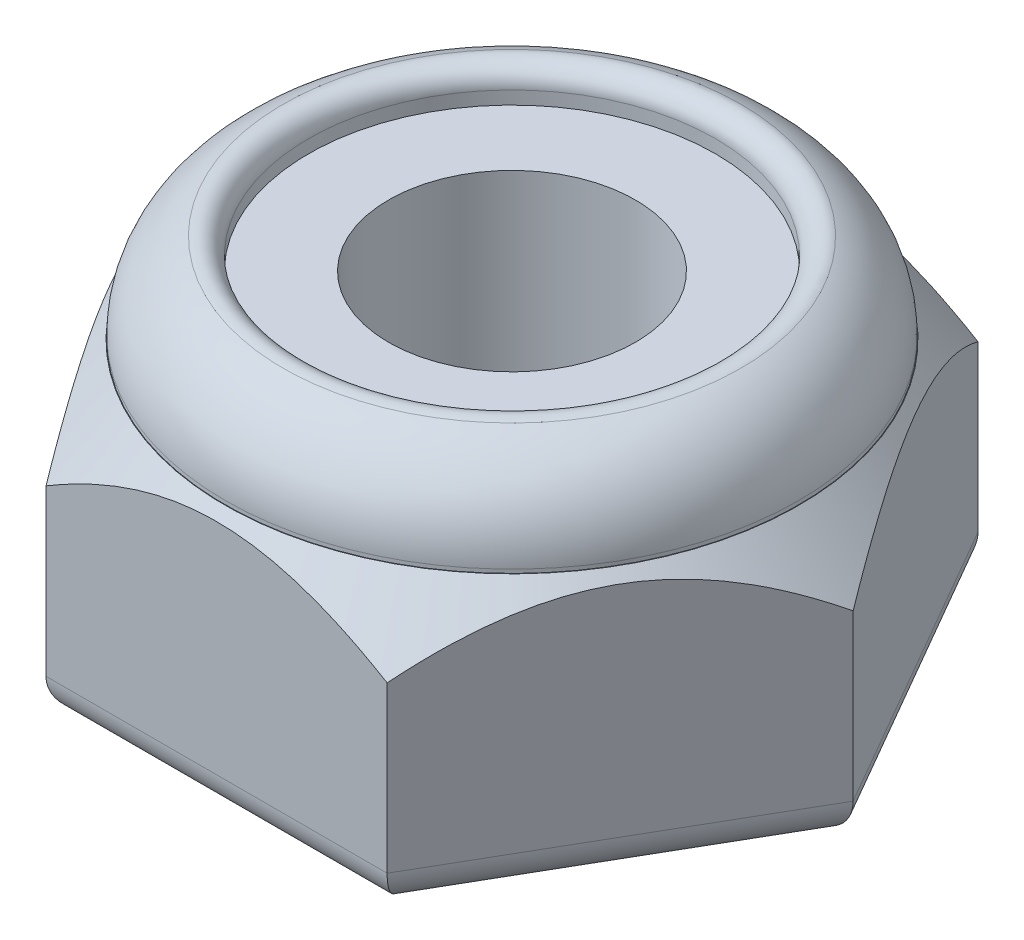
ISO-10303-21;
HEADER;
FILE_DESCRIPTION(('STEP AP214'),'2;1');
FILE_NAME('part.step','',(''),(''),'','','');
FILE_SCHEMA(('AUTOMOTIVE_DESIGN { 1 0 10303 214 1 1 1 1 }'));
ENDSEC;
DATA;
#1=APPLICATION_CONTEXT('core data for automotive mechanical design processes');
#2=APPLICATION_PROTOCOL_DEFINITION('international standard','automotive_design',2000,#1);
#3=PRODUCT_CONTEXT('',#1,'mechanical');
#4=PRODUCT('Part','Part','',(#3));
#5=PRODUCT_RELATED_PRODUCT_CATEGORY('part','',(#4));
#6=PRODUCT_DEFINITION_FORMATION('','',#4);
#7=PRODUCT_DEFINITION_CONTEXT('part definition',#1,'design');
#8=PRODUCT_DEFINITION('design','',#6,#7);
#9=PRODUCT_DEFINITION_SHAPE('','',#8);
#10=(LENGTH_UNIT() NAMED_UNIT(*) SI_UNIT(.MILLI.,.METRE.));
#11=(NAMED_UNIT(*) PLANE_ANGLE_UNIT() SI_UNIT($,.RADIAN.));
#12=(NAMED_UNIT(*) SI_UNIT($,.STERADIAN.) SOLID_ANGLE_UNIT());
#13=UNCERTAINTY_MEASURE_WITH_UNIT(LENGTH_MEASURE(1.E-05),#10,'distance_accuracy_value','');
#14=(GEOMETRIC_REPRESENTATION_CONTEXT(3) GLOBAL_UNCERTAINTY_ASSIGNED_CONTEXT((#13)) GLOBAL_UNIT_ASSIGNED_CONTEXT((#10,
#11,#12)) REPRESENTATION_CONTEXT('',''));
#15=CARTESIAN_POINT('',(0.,0.,0.));
#16=DIRECTION('',(0.,0.,1.));
#17=DIRECTION('',(1.,0.,0.));
#18=AXIS2_PLACEMENT_3D('',#15,#16,#17);
#19=CARTESIAN_POINT('',(0.,4.9784,0.));
#20=DIRECTION('',(0.,-1.,0.));
#21=DIRECTION('',(0.,0.,-1.));
#22=AXIS2_PLACEMENT_3D('',#19,#20,#21);
#23=CYLINDRICAL_SURFACE('',#22,3.937);
#24=CARTESIAN_POINT('',(0.,3.7084,0.));
#25=DIRECTION('',(0.,1.,0.));
#26=DIRECTION('',(0.,0.,1.));
#27=AXIS2_PLACEMENT_3D('',#24,#25,#26);
#28=CIRCLE('',#27,3.937);
#29=CARTESIAN_POINT('',(0.,3.7084,3.937));
#30=VERTEX_POINT('',#29);
#31=EDGE_CURVE('E244',#30,#30,#28,.T.);
#32=ORIENTED_EDGE('',*,*,#31,.F.);
#33=EDGE_LOOP('',(#32));
#34=FACE_BOUND('',#33,.T.);
#35=CARTESIAN_POINT('',(0.,3.6576,0.));
#36=DIRECTION('',(0.,-1.,0.));
#37=DIRECTION('',(0.,0.,-1.));
#38=AXIS2_PLACEMENT_3D('',#35,#36,#37);
#39=CIRCLE('',#38,3.937);
#40=CARTESIAN_POINT('',(0.,3.6576,-3.937));
#41=VERTEX_POINT('',#40);
#42=EDGE_CURVE('E19',#41,#41,#39,.F.);
#43=ORIENTED_EDGE('',*,*,#42,.T.);
#44=EDGE_LOOP('',(#43));
#45=FACE_BOUND('',#44,.T.);
#46=ADVANCED_FACE('F16',(#34,#45),#23,.T.);
#47=CARTESIAN_POINT('',(0.,3.7084,0.));
#48=DIRECTION('',(0.,1.,0.));
#49=DIRECTION('',(0.,0.,1.));
#50=AXIS2_PLACEMENT_3D('',#47,#48,#49);
#51=TOROIDAL_SURFACE('',#50,2.667,1.27);
#52=ORIENTED_EDGE('',*,*,#31,.T.);
#53=EDGE_LOOP('',(#52));
#54=FACE_BOUND('',#53,.T.);
#55=CARTESIAN_POINT('',(0.,4.88572150982644,0.));
#56=DIRECTION('',(0.,-1.,0.));
#57=DIRECTION('',(0.,0.,-1.));
#58=AXIS2_PLACEMENT_3D('',#55,#56,#57);
#59=CIRCLE('',#58,3.14325);
#60=CARTESIAN_POINT('',(0.,4.88572150982644,-3.14325));
#61=VERTEX_POINT('',#60);
#62=EDGE_CURVE('E238',#61,#61,#59,.F.);
#63=ORIENTED_EDGE('',*,*,#62,.F.);
#64=EDGE_LOOP('',(#63));
#65=FACE_BOUND('',#64,.T.);
#66=ADVANCED_FACE('F134',(#54,#65),#51,.T.);
#67=CARTESIAN_POINT('',(2.34315,3.6576,4.05845484975502));
#68=DIRECTION('',(0.,-1.,0.));
#69=DIRECTION('',(0.,0.,-1.));
#70=AXIS2_PLACEMENT_3D('',#67,#68,#69);
#71=PLANE('',#70);
#72=ORIENTED_EDGE('',*,*,#42,.F.);
#73=EDGE_LOOP('',(#72));
#74=FACE_BOUND('',#73,.T.);
#75=CARTESIAN_POINT('',(0.,3.65760000011051,0.));
#76=DIRECTION('',(0.,-1.,0.));
#77=DIRECTION('',(0.,0.,-1.));
#78=AXIS2_PLACEMENT_3D('',#75,#76,#77);
#79=CIRCLE('',#78,3.94407100938664);
#80=CARTESIAN_POINT('',(0.,3.65760000011051,-3.94407100938664));
#81=VERTEX_POINT('',#80);
#82=EDGE_CURVE('E119',#81,#81,#79,.T.);
#83=ORIENTED_EDGE('',*,*,#82,.F.);
#84=EDGE_LOOP('',(#83));
#85=FACE_BOUND('',#84,.T.);
#86=ADVANCED_FACE('F129',(#74,#85),#71,.F.);
#87=CARTESIAN_POINT('',(0.,4.65025720786115,0.));
#88=DIRECTION('',(0.,-1.,0.));
#89=DIRECTION('',(0.,0.,-1.));
#90=AXIS2_PLACEMENT_3D('',#87,#88,#89);
#91=TOROIDAL_SURFACE('',#90,3.048,0.254);
#92=CARTESIAN_POINT('',(0.,4.65025720786115,0.));
#93=DIRECTION('',(0.,1.,0.));
#94=DIRECTION('',(0.,0.,1.));
#95=AXIS2_PLACEMENT_3D('',#92,#93,#94);
#96=CIRCLE('',#95,2.794);
#97=CARTESIAN_POINT('',(0.,4.65025720786115,2.794));
#98=VERTEX_POINT('',#97);
#99=EDGE_CURVE('E104',#98,#98,#96,.F.);
#100=ORIENTED_EDGE('',*,*,#99,.T.);
#101=EDGE_LOOP('',(#100));
#102=FACE_BOUND('',#101,.T.);
#103=ORIENTED_EDGE('',*,*,#62,.T.);
#104=EDGE_LOOP('',(#103));
#105=FACE_BOUND('',#104,.T.);
#106=ADVANCED_FACE('F125',(#102,#105),#91,.T.);
#107=CARTESIAN_POINT('',(0.,2.76773860969115,0.));
#108=DIRECTION('',(0.,-1.,0.));
#109=DIRECTION('',(0.,0.,-1.));
#110=AXIS2_PLACEMENT_3D('',#107,#108,#109);
#111=CONICAL_SURFACE('',#110,4.69075337389313,0.698131700802158);
#112=CARTESIAN_POINT('',(-4.68630000001476,2.77304593398821,-5.33338044389321E-11));
#113=CARTESIAN_POINT('',(-4.65177717141793,2.81418235889091,0.0597952931149053));
#114=CARTESIAN_POINT('',(-4.61695780288956,2.85432113110728,0.120104208500933));
#115=CARTESIAN_POINT('',(-4.54666264441453,2.93230661020916,0.241858994511412));
#116=CARTESIAN_POINT('',(-4.51118655194523,2.97015222462005,0.303305389120424));
#117=CARTESIAN_POINT('',(-4.40329561885259,3.08018701500149,0.490177966909937));
#118=CARTESIAN_POINT('',(-4.32983334004397,3.14837015576205,0.617418366247689));
#119=CARTESIAN_POINT('',(-4.1797796499728,3.27092778609509,0.877318981315214));
#120=CARTESIAN_POINT('',(-4.10317943932402,3.32525984886677,1.00999443802899));
#121=CARTESIAN_POINT('',(-3.94747591651277,3.41577217646148,1.27968085045525));
#122=CARTESIAN_POINT('',(-3.86837998243724,3.45200143013375,1.4166790269463));
#123=CARTESIAN_POINT('',(-3.73746585196202,3.49372811243502,1.64342895235813));
#124=CARTESIAN_POINT('',(-3.68614686019516,3.50560413715319,1.73231605349153));
#125=CARTESIAN_POINT('',(-3.58316406708587,3.52008140702852,1.91068748346216));
#126=CARTESIAN_POINT('',(-3.53150020834088,3.5226810675312,2.00017191172355));
#127=CARTESIAN_POINT('',(-3.42855034551142,3.51847006524789,2.17848630477643));
#128=CARTESIAN_POINT('',(-3.3772638088531,3.51171021118306,2.26731719201287));
#129=CARTESIAN_POINT('',(-3.27519197708947,3.48921023555424,2.4441107906491));
#130=CARTESIAN_POINT('',(-3.22440670715057,3.4734696654174,2.53207345845939));
#131=CARTESIAN_POINT('',(-3.10963060134479,3.42817062222156,2.73087150520989));
#132=CARTESIAN_POINT('',(-3.04589899577138,3.39598542076133,2.84125788411099));
#133=CARTESIAN_POINT('',(-2.92018166739655,3.32004827846255,3.05900668424801));
#134=CARTESIAN_POINT('',(-2.85819691962206,3.27629001415058,3.16636741668776));
#135=CARTESIAN_POINT('',(-2.735889068299,3.17910361386979,3.37821082934389));
#136=CARTESIAN_POINT('',(-2.67557364738244,3.12563730731956,3.48268020285126));
#137=CARTESIAN_POINT('',(-2.55683004320588,3.01104764609313,3.68835015835892));
#138=CARTESIAN_POINT('',(-2.49840123089761,2.94992687749399,3.78955182990274));
#139=CARTESIAN_POINT('',(-2.42439626092569,2.86741854625153,3.91773219790672));
#140=CARTESIAN_POINT('',(-2.40802320106583,2.84883596648691,3.94609116945937));
#141=CARTESIAN_POINT('',(-2.3754621576302,2.81125673907332,4.00248855103733));
#142=CARTESIAN_POINT('',(-2.35927376441604,2.79226151161516,4.03052767057717));
#143=CARTESIAN_POINT('',(-2.3431499999717,2.77304593399368,4.05845484980404));
#144=B_SPLINE_CURVE_WITH_KNOTS('',3,(#112,#113,#114,#115,#116,#117,#118,#119,#120,#121,#122,
#123,#124,#125,#126,#127,#128,#129,#130,#131,#132,#133,#134,#135,#136,#137,#138,#139,#140,#141,
#142,#143),.UNSPECIFIED.,.F.,.F.,(4,2,2,2,2,2,2,2,2,2,2,2,2,2,2,4),(0.,0.241096809088565,
0.48230758945251,0.967637153847366,1.45443592242802,1.93991010956963,2.24950193433618,
2.55914664324831,2.86711700071403,3.17510274216898,3.56882084711336,3.96275452403261,
4.35827201930639,4.75365624679115,4.86660838982692,4.97921936905084),.UNSPECIFIED.);
#145=CARTESIAN_POINT('',(-4.68630000002839,2.77304593399358,0.));
#146=VERTEX_POINT('',#145);
#147=CARTESIAN_POINT('',(-2.34315000001419,2.77304593399358,4.05845484977959));
#148=VERTEX_POINT('',#147);
#149=EDGE_CURVE('E91',#146,#148,#144,.T.);
#150=ORIENTED_EDGE('',*,*,#149,.T.);
#151=CARTESIAN_POINT('',(-2.34315000005357,2.77304593398822,4.05845484974113));
#152=CARTESIAN_POINT('',(-2.27415972170409,2.81414935271336,4.05845484974989));
#153=CARTESIAN_POINT('',(-2.20457738522044,2.85425669884705,4.05845484975361));
#154=CARTESIAN_POINT('',(-2.06410193528095,2.93218331968194,4.05845484975642));
#155=CARTESIAN_POINT('',(-1.99320821641151,2.9700015013142,4.05845484975551));
#156=CARTESIAN_POINT('',(-1.77754688772429,3.07999086386455,4.05845484975401));
#157=CARTESIAN_POINT('',(-1.63068545869954,3.1481589403704,4.05845484975469));
#158=CARTESIAN_POINT('',(-1.33052752457963,3.27077676919262,4.05845484975534));
#159=CARTESIAN_POINT('',(-1.17720631609342,3.32516696804196,4.0584548497553));
#160=CARTESIAN_POINT('',(-0.86561350380778,3.41574608766059,4.05845484975473));
#161=CARTESIAN_POINT('',(-0.707359229311903,3.45199244874899,4.0584548497542));
#162=CARTESIAN_POINT('',(-0.456822143345071,3.49192146546895,4.05845484975548));
#163=CARTESIAN_POINT('',(-0.365672921156202,3.50290887295604,4.05845484975637));
#164=CARTESIAN_POINT('',(-0.183016322004482,3.51758027913678,4.05845484975366));
#165=CARTESIAN_POINT('',(-0.0915105175250816,3.52128341037061,4.05845484975007));
#166=CARTESIAN_POINT('',(0.104649468641441,3.52128177491765,4.0584548497495));
#167=CARTESIAN_POINT('',(0.209305100872023,3.51643705333648,4.05845484975354));
#168=CARTESIAN_POINT('',(0.41778718190987,3.49730239560235,4.05845484975649));
#169=CARTESIAN_POINT('',(0.521613181352877,3.48300765111694,4.05845484975541));
#170=CARTESIAN_POINT('',(0.728332544913561,3.44553375886282,4.05845484975462));
#171=CARTESIAN_POINT('',(0.831215331558566,3.42229697724238,4.05845484975491));
#172=CARTESIAN_POINT('',(1.03487580391125,3.36791830054733,4.05845484975512));
#173=CARTESIAN_POINT('',(1.13565289468809,3.33677420321768,4.05845484975504));
#174=CARTESIAN_POINT('',(1.33273383822163,3.26838741918099,4.05845484975499));
#175=CARTESIAN_POINT('',(1.42908716226035,3.23128582684656,4.05845484975501));
#176=CARTESIAN_POINT('',(1.61947291708309,3.15151071591982,4.05845484975502));
#177=CARTESIAN_POINT('',(1.71350470709807,3.10883567899407,4.05845484975502));
#178=CARTESIAN_POINT('',(1.89803195382395,3.01941532331662,4.05845484975501));
#179=CARTESIAN_POINT('',(1.98855798046432,2.97273255726059,4.05845484975502));
#180=CARTESIAN_POINT('',(2.16742834958163,2.87556944084479,4.05845484975502));
#181=CARTESIAN_POINT('',(2.25577492892455,2.82509321932285,4.05845484975502));
#182=CARTESIAN_POINT('',(2.34315000005566,2.77304593399424,4.05845484975502));
#183=B_SPLINE_CURVE_WITH_KNOTS('',3,(#151,#152,#153,#154,#155,#156,#157,#158,#159,#160,#161,
#162,#163,#164,#165,#166,#167,#168,#169,#170,#171,#172,#173,#174,#175,#176,#177,#178,#179,#180,
#181,#182),.UNSPECIFIED.,.F.,.F.,(4,2,2,2,2,2,2,2,2,2,2,2,2,2,2,4),(0.,0.24090330355952,
0.481920744736242,0.967059466968447,1.4542606837498,1.93990959177134,2.21507934695766,
2.4895253838939,2.80337599596431,3.11738642360393,3.43345557972405,3.74961286055439,
4.0591611810716,4.36879400620232,4.67425708545866,4.97939238068026),.UNSPECIFIED.);
#184=CARTESIAN_POINT('',(2.34315000001419,2.77304593399358,4.05845484977959));
#185=VERTEX_POINT('',#184);
#186=EDGE_CURVE('E83',#148,#185,#183,.T.);
#187=ORIENTED_EDGE('',*,*,#186,.T.);
#188=CARTESIAN_POINT('',(2.3431499999612,2.77304593398822,4.05845484979446));
#189=CARTESIAN_POINT('',(2.37767282857321,2.81418235889091,3.99865955663499));
#190=CARTESIAN_POINT('',(2.41249219710801,2.85432113110729,3.93835064125267));
#191=CARTESIAN_POINT('',(2.48278735558791,2.93230661020917,3.816595855245));
#192=CARTESIAN_POINT('',(2.51826344805563,2.97015222462005,3.75514946063508));
#193=CARTESIAN_POINT('',(2.62615438114571,3.0801870150015,3.56827688284408));
#194=CARTESIAN_POINT('',(2.69961665995557,3.14837015576206,3.44103648350706));
#195=CARTESIAN_POINT('',(2.84967035002766,3.2709277860951,3.18113586844006));
#196=CARTESIAN_POINT('',(2.9262705606761,3.32525984886677,3.04846041172609));
#197=CARTESIAN_POINT('',(3.08197408348711,3.41577217646148,2.77877399929969));
#198=CARTESIAN_POINT('',(3.16107001756274,3.45200143013376,2.64177582280869));
#199=CARTESIAN_POINT('',(3.291984148038,3.49372811243503,2.41502589739689));
#200=CARTESIAN_POINT('',(3.34330313980485,3.50560413715319,2.32613879626348));
#201=CARTESIAN_POINT('',(3.44628593291413,3.52008140702853,2.14776736629285));
#202=CARTESIAN_POINT('',(3.49794979165912,3.52268106753121,2.05828293803146));
#203=CARTESIAN_POINT('',(3.60089965448859,3.51847006524789,1.87996854497858));
#204=CARTESIAN_POINT('',(3.6521861911469,3.51171021118306,1.79113765774214));
#205=CARTESIAN_POINT('',(3.75425802291053,3.48921023555425,1.61434405910591));
#206=CARTESIAN_POINT('',(3.80504329284943,3.47346966541741,1.52638139129562));
#207=CARTESIAN_POINT('',(3.91981939865521,3.42817062222156,1.32758334454512));
#208=CARTESIAN_POINT('',(3.98355100422862,3.39598542076133,1.21719696564402));
#209=CARTESIAN_POINT('',(4.10926833260345,3.32004827846255,0.999448165506998));
#210=CARTESIAN_POINT('',(4.17125308037794,3.27629001415058,0.892087433067249));
#211=CARTESIAN_POINT('',(4.293560931701,3.17910361386979,0.680244020411123));
#212=CARTESIAN_POINT('',(4.35387635261756,3.12563730731956,0.575774646903748));
#213=CARTESIAN_POINT('',(4.47261995679412,3.01104764609313,0.370104691396085));
#214=CARTESIAN_POINT('',(4.53104876910239,2.94992687749399,0.268903019852267));
#215=CARTESIAN_POINT('',(4.60505373907431,2.86741854625153,0.140722651848287));
#216=CARTESIAN_POINT('',(4.62142679893417,2.84883596648691,0.112363680295637));
#217=CARTESIAN_POINT('',(4.6539878423698,2.81125673907332,0.0559662987176779));
#218=CARTESIAN_POINT('',(4.67017623558396,2.79226151161516,0.0279271791778418));
#219=CARTESIAN_POINT('',(4.6863000000283,2.77304593399368,-4.90270010654762E-11));
#220=B_SPLINE_CURVE_WITH_KNOTS('',3,(#188,#189,#190,#191,#192,#193,#194,#195,#196,#197,#198,
#199,#200,#201,#202,#203,#204,#205,#206,#207,#208,#209,#210,#211,#212,#213,#214,#215,#216,#217,
#218,#219),.UNSPECIFIED.,.F.,.F.,(4,2,2,2,2,2,2,2,2,2,2,2,2,2,2,4),(0.,0.241096809088565,
0.48230758945251,0.967637153847364,1.45443592242802,1.93991010956962,2.24950193433617,
2.5591466432483,2.86711700071402,3.17510274216897,3.56882084711336,3.9627545240326,
4.35827201930639,4.75365624679114,4.86660838982692,4.97921936905084),.UNSPECIFIED.);
#221=CARTESIAN_POINT('',(4.68630000001419,2.7730459340105,-2.45819040202403E-11));
#222=VERTEX_POINT('',#221);
#223=EDGE_CURVE('E88',#185,#222,#220,.T.);
#224=ORIENTED_EDGE('',*,*,#223,.T.);
#225=CARTESIAN_POINT('',(4.68630000001476,2.77304593398822,5.33267015141622E-11));
#226=CARTESIAN_POINT('',(4.65177717141792,2.81418235889091,-0.0597952931149122));
#227=CARTESIAN_POINT('',(4.61695780288956,2.85432113110729,-0.12010420850094));
#228=CARTESIAN_POINT('',(4.54666264441452,2.93230661020917,-0.241858994511418));
#229=CARTESIAN_POINT('',(4.51118655194522,2.97015222462005,-0.303305389120429));
#230=CARTESIAN_POINT('',(4.40329561885258,3.0801870150015,-0.490177966909942));
#231=CARTESIAN_POINT('',(4.32983334004397,3.14837015576206,-0.617418366247693));
#232=CARTESIAN_POINT('',(4.1797796499728,3.27092778609509,-0.877318981315217));
#233=CARTESIAN_POINT('',(4.10317943932402,3.32525984886677,-1.00999443802899));
#234=CARTESIAN_POINT('',(3.94747591651277,3.41577217646148,-1.27968085045525));
#235=CARTESIAN_POINT('',(3.86837998243724,3.45200143013375,-1.4166790269463));
#236=CARTESIAN_POINT('',(3.73746585196202,3.49372811243502,-1.64342895235813));
#237=CARTESIAN_POINT('',(3.68614686019516,3.50560413715319,-1.73231605349153));
#238=CARTESIAN_POINT('',(3.58316406708587,3.52008140702852,-1.91068748346216));
#239=CARTESIAN_POINT('',(3.53150020834088,3.5226810675312,-2.00017191172355));
#240=CARTESIAN_POINT('',(3.42855034551142,3.51847006524789,-2.17848630477643));
#241=CARTESIAN_POINT('',(3.3772638088531,3.51171021118306,-2.26731719201287));
#242=CARTESIAN_POINT('',(3.27519197708947,3.48921023555424,-2.4441107906491));
#243=CARTESIAN_POINT('',(3.22440670715057,3.4734696654174,-2.53207345845939));
#244=CARTESIAN_POINT('',(3.10963060134479,3.42817062222156,-2.73087150520989));
#245=CARTESIAN_POINT('',(3.04589899577138,3.39598542076133,-2.84125788411098));
#246=CARTESIAN_POINT('',(2.92018166739655,3.32004827846255,-3.05900668424801));
#247=CARTESIAN_POINT('',(2.85819691962206,3.27629001415058,-3.16636741668776));
#248=CARTESIAN_POINT('',(2.735889068299,3.17910361386979,-3.37821082934388));
#249=CARTESIAN_POINT('',(2.67557364738245,3.12563730731956,-3.48268020285126));
#250=CARTESIAN_POINT('',(2.55683004320588,3.01104764609313,-3.68835015835892));
#251=CARTESIAN_POINT('',(2.49840123089761,2.94992687749399,-3.78955182990274));
#252=CARTESIAN_POINT('',(2.42439626092569,2.86741854625153,-3.91773219790672));
#253=CARTESIAN_POINT('',(2.40802320106583,2.84883596648691,-3.94609116945937));
#254=CARTESIAN_POINT('',(2.3754621576302,2.81125673907332,-4.00248855103733));
#255=CARTESIAN_POINT('',(2.35927376441604,2.79226151161516,-4.03052767057717));
#256=CARTESIAN_POINT('',(2.3431499999717,2.77304593399368,-4.05845484980404));
#257=B_SPLINE_CURVE_WITH_KNOTS('',3,(#225,#226,#227,#228,#229,#230,#231,#232,#233,#234,#235,
#236,#237,#238,#239,#240,#241,#242,#243,#244,#245,#246,#247,#248,#249,#250,#251,#252,#253,#254,
#255,#256),.UNSPECIFIED.,.F.,.F.,(4,2,2,2,2,2,2,2,2,2,2,2,2,2,2,4),(0.,0.241096809088563,
0.482307589452507,0.967637153847359,1.45443592242801,1.93991010956962,2.24950193433616,
2.55914664324829,2.86711700071401,3.17510274216897,3.56882084711335,3.96275452403259,
4.35827201930638,4.75365624679114,4.86660838982692,4.97921936905084),.UNSPECIFIED.);
#258=CARTESIAN_POINT('',(2.34315000001419,2.77304593399358,-4.0584548497796));
#259=VERTEX_POINT('',#258);
#260=EDGE_CURVE('E194',#222,#259,#257,.T.);
#261=ORIENTED_EDGE('',*,*,#260,.T.);
#262=CARTESIAN_POINT('',(2.34315000005357,2.77304593398821,-4.05845484974114));
#263=CARTESIAN_POINT('',(2.27415972170409,2.81414935271335,-4.05845484974989));
#264=CARTESIAN_POINT('',(2.20457738522045,2.85425669884704,-4.05845484975361));
#265=CARTESIAN_POINT('',(2.06410193528096,2.93218331968193,-4.05845484975643));
#266=CARTESIAN_POINT('',(1.99320821641151,2.97000150131419,-4.05845484975552));
#267=CARTESIAN_POINT('',(1.77754688772429,3.07999086386454,-4.05845484975402));
#268=CARTESIAN_POINT('',(1.63068545869954,3.1481589403704,-4.0584548497547));
#269=CARTESIAN_POINT('',(1.33052752457963,3.27077676919261,-4.05845484975534));
#270=CARTESIAN_POINT('',(1.17720631609342,3.32516696804195,-4.0584548497553));
#271=CARTESIAN_POINT('',(0.865613503807778,3.41574608766058,-4.05845484975474));
#272=CARTESIAN_POINT('',(0.707359229311901,3.45199244874898,-4.0584548497542));
#273=CARTESIAN_POINT('',(0.456822143345069,3.49192146546895,-4.05845484975548));
#274=CARTESIAN_POINT('',(0.365672921156201,3.50290887295604,-4.05845484975637));
#275=CARTESIAN_POINT('',(0.183016322004481,3.51758027913677,-4.05845484975367));
#276=CARTESIAN_POINT('',(0.0915105175250814,3.5212834103706,-4.05845484975008));
#277=CARTESIAN_POINT('',(-0.104649468641441,3.52128177491764,-4.0584548497495));
#278=CARTESIAN_POINT('',(-0.209305100872023,3.51643705333648,-4.05845484975354));
#279=CARTESIAN_POINT('',(-0.41778718190987,3.49730239560234,-4.0584548497565));
#280=CARTESIAN_POINT('',(-0.521613181352877,3.48300765111693,-4.05845484975542));
#281=CARTESIAN_POINT('',(-0.728332544913562,3.44553375886281,-4.05845484975462));
#282=CARTESIAN_POINT('',(-0.831215331558566,3.42229697724237,-4.05845484975491));
#283=CARTESIAN_POINT('',(-1.03487580391125,3.36791830054732,-4.05845484975513));
#284=CARTESIAN_POINT('',(-1.13565289468809,3.33677420321767,-4.05845484975505));
#285=CARTESIAN_POINT('',(-1.33273383822163,3.26838741918098,-4.05845484975499));
#286=CARTESIAN_POINT('',(-1.42908716226035,3.23128582684655,-4.05845484975501));
#287=CARTESIAN_POINT('',(-1.61947291708309,3.15151071591982,-4.05845484975503));
#288=CARTESIAN_POINT('',(-1.71350470709807,3.10883567899406,-4.05845484975502));
#289=CARTESIAN_POINT('',(-1.89803195382395,3.01941532331662,-4.05845484975502));
#290=CARTESIAN_POINT('',(-1.98855798046431,2.97273255726059,-4.05845484975502));
#291=CARTESIAN_POINT('',(-2.16742834958162,2.87556944084479,-4.05845484975502));
#292=CARTESIAN_POINT('',(-2.25577492892455,2.82509321932284,-4.05845484975502));
#293=CARTESIAN_POINT('',(-2.34315000005566,2.77304593399424,-4.05845484975502));
#294=B_SPLINE_CURVE_WITH_KNOTS('',3,(#262,#263,#264,#265,#266,#267,#268,#269,#270,#271,#272,
#273,#274,#275,#276,#277,#278,#279,#280,#281,#282,#283,#284,#285,#286,#287,#288,#289,#290,#291,
#292,#293),.UNSPECIFIED.,.F.,.F.,(4,2,2,2,2,2,2,2,2,2,2,2,2,2,2,4),(0.,0.24090330355952,
0.481920744736243,0.96705946696845,1.4542606837498,1.93990959177135,2.21507934695766,
2.48952538389391,2.80337599596432,3.11738642360394,3.43345557972405,3.74961286055439,
4.0591611810716,4.36879400620232,4.67425708545866,4.97939238068026),.UNSPECIFIED.);
#295=CARTESIAN_POINT('',(-2.34315000001419,2.77304593399358,-4.0584548497796));
#296=VERTEX_POINT('',#295);
#297=EDGE_CURVE('E204',#259,#296,#294,.T.);
#298=ORIENTED_EDGE('',*,*,#297,.T.);
#299=CARTESIAN_POINT('',(-2.3431499999612,2.77304593398821,-4.05845484979447));
#300=CARTESIAN_POINT('',(-2.37767282857321,2.81418235889091,-3.99865955663499));
#301=CARTESIAN_POINT('',(-2.41249219710802,2.85432113110728,-3.93835064125268));
#302=CARTESIAN_POINT('',(-2.48278735558791,2.93230661020916,-3.81659585524501));
#303=CARTESIAN_POINT('',(-2.51826344805563,2.97015222462005,-3.75514946063508));
#304=CARTESIAN_POINT('',(-2.62615438114571,3.08018701500149,-3.56827688284409));
#305=CARTESIAN_POINT('',(-2.69961665995557,3.14837015576205,-3.44103648350706));
#306=CARTESIAN_POINT('',(-2.84967035002766,3.27092778609509,-3.18113586844007));
#307=CARTESIAN_POINT('',(-2.9262705606761,3.32525984886676,-3.0484604117261));
#308=CARTESIAN_POINT('',(-3.08197408348711,3.41577217646147,-2.7787739992997));
#309=CARTESIAN_POINT('',(-3.16107001756274,3.45200143013375,-2.6417758228087));
#310=CARTESIAN_POINT('',(-3.291984148038,3.49372811243502,-2.4150258973969));
#311=CARTESIAN_POINT('',(-3.34330313980485,3.50560413715318,-2.32613879626349));
#312=CARTESIAN_POINT('',(-3.44628593291413,3.52008140702852,-2.14776736629286));
#313=CARTESIAN_POINT('',(-3.49794979165912,3.5226810675312,-2.05828293803147));
#314=CARTESIAN_POINT('',(-3.60089965448859,3.51847006524788,-1.87996854497859));
#315=CARTESIAN_POINT('',(-3.6521861911469,3.51171021118305,-1.79113765774215));
#316=CARTESIAN_POINT('',(-3.75425802291053,3.48921023555424,-1.61434405910592));
#317=CARTESIAN_POINT('',(-3.80504329284944,3.4734696654174,-1.52638139129563));
#318=CARTESIAN_POINT('',(-3.91981939865521,3.42817062222155,-1.32758334454513));
#319=CARTESIAN_POINT('',(-3.98355100422863,3.39598542076132,-1.21719696564403));
#320=CARTESIAN_POINT('',(-4.10926833260346,3.32004827846254,-0.999448165507007));
#321=CARTESIAN_POINT('',(-4.17125308037794,3.27629001415057,-0.892087433067259));
#322=CARTESIAN_POINT('',(-4.29356093170101,3.17910361386978,-0.680244020411133));
#323=CARTESIAN_POINT('',(-4.35387635261756,3.12563730731955,-0.575774646903757));
#324=CARTESIAN_POINT('',(-4.47261995679413,3.01104764609312,-0.370104691396094));
#325=CARTESIAN_POINT('',(-4.53104876910239,2.94992687749399,-0.268903019852276));
#326=CARTESIAN_POINT('',(-4.60505373907432,2.86741854625152,-0.140722651848295));
#327=CARTESIAN_POINT('',(-4.62142679893418,2.84883596648691,-0.112363680295645));
#328=CARTESIAN_POINT('',(-4.6539878423698,2.81125673907331,-0.0559662987176854));
#329=CARTESIAN_POINT('',(-4.67017623558397,2.79226151161515,-0.0279271791778493));
#330=CARTESIAN_POINT('',(-4.68630000002831,2.77304593399367,4.90195592876359E-11));
#331=B_SPLINE_CURVE_WITH_KNOTS('',3,(#299,#300,#301,#302,#303,#304,#305,#306,#307,#308,#309,
#310,#311,#312,#313,#314,#315,#316,#317,#318,#319,#320,#321,#322,#323,#324,#325,#326,#327,#328,
#329,#330),.UNSPECIFIED.,.F.,.F.,(4,2,2,2,2,2,2,2,2,2,2,2,2,2,2,4),(0.,0.241096809088565,
0.482307589452509,0.967637153847361,1.45443592242802,1.93991010956962,2.24950193433617,
2.5591466432483,2.86711700071402,3.17510274216897,3.56882084711335,3.9627545240326,
4.35827201930639,4.75365624679114,4.86660838982692,4.97921936905084),.UNSPECIFIED.);
#332=EDGE_CURVE('E210',#296,#146,#331,.T.);
#333=ORIENTED_EDGE('',*,*,#332,.T.);
#334=EDGE_LOOP('',(#150,#187,#224,#261,#298,#333));
#335=FACE_BOUND('',#334,.T.);
#336=ORIENTED_EDGE('',*,*,#82,.T.);
#337=EDGE_LOOP('',(#336));
#338=FACE_BOUND('',#337,.T.);
#339=ADVANCED_FACE('F85',(#335,#338),#111,.T.);
#340=CARTESIAN_POINT('',(0.,4.4704,0.));
#341=DIRECTION('',(0.,1.,0.));
#342=DIRECTION('',(0.,0.,1.));
#343=AXIS2_PLACEMENT_3D('',#340,#341,#342);
#344=CYLINDRICAL_SURFACE('',#343,2.794);
#345=ORIENTED_EDGE('',*,*,#99,.F.);
#346=EDGE_LOOP('',(#345));
#347=FACE_BOUND('',#346,.T.);
#348=CARTESIAN_POINT('',(0.,4.4704,0.));
#349=DIRECTION('',(0.,1.,0.));
#350=DIRECTION('',(0.,0.,1.));
#351=AXIS2_PLACEMENT_3D('',#348,#349,#350);
#352=CIRCLE('',#351,2.794);
#353=CARTESIAN_POINT('',(0.,4.4704,2.794));
#354=VERTEX_POINT('',#353);
#355=EDGE_CURVE('E202',#354,#354,#352,.T.);
#356=ORIENTED_EDGE('',*,*,#355,.F.);
#357=EDGE_LOOP('',(#356));
#358=FACE_BOUND('',#357,.T.);
#359=ADVANCED_FACE('F406',(#347,#358),#344,.F.);
#360=CARTESIAN_POINT('',(2.34315,3.6576,4.05845484975502));
#361=DIRECTION('',(-0.866025403784439,0.,-0.499999999999999));
#362=DIRECTION('',(-0.499999999999999,0.,0.866025403784439));
#363=AXIS2_PLACEMENT_3D('',#360,#361,#362);
#364=PLANE('',#363);
#365=DIRECTION('',(-0.499999999999999,0.,0.866025403784439));
#366=VECTOR('',#365,1.);
#367=CARTESIAN_POINT('',(2.34315,0.508,4.05845484975502));
#368=LINE('',#367,#366);
#369=CARTESIAN_POINT('',(4.6863,0.508,0.));
#370=VERTEX_POINT('',#369);
#371=CARTESIAN_POINT('',(2.34315000000001,0.508,4.05845484975502));
#372=VERTEX_POINT('',#371);
#373=EDGE_CURVE('E268',#370,#372,#368,.T.);
#374=ORIENTED_EDGE('',*,*,#373,.F.);
#375=DIRECTION('',(0.,1.,0.));
#376=VECTOR('',#375,1.);
#377=CARTESIAN_POINT('',(4.6863,3.6576,0.));
#378=LINE('',#377,#376);
#379=EDGE_CURVE('E102',#370,#222,#378,.T.);
#380=ORIENTED_EDGE('',*,*,#379,.T.);
#381=ORIENTED_EDGE('',*,*,#223,.F.);
#382=DIRECTION('',(0.,1.,0.));
#383=VECTOR('',#382,1.);
#384=CARTESIAN_POINT('',(2.34315000000001,3.6576,4.05845484975502));
#385=LINE('',#384,#383);
#386=EDGE_CURVE('E95',#185,#372,#385,.F.);
#387=ORIENTED_EDGE('',*,*,#386,.T.);
#388=EDGE_LOOP('',(#374,#380,#381,#387));
#389=FACE_BOUND('',#388,.T.);
#390=ADVANCED_FACE('F99',(#389),#364,.F.);
#391=CARTESIAN_POINT('',(-2.34315,3.6576,4.05845484975501));
#392=DIRECTION('',(0.,0.,-1.));
#393=DIRECTION('',(-1.,0.,0.));
#394=AXIS2_PLACEMENT_3D('',#391,#392,#393);
#395=PLANE('',#394);
#396=DIRECTION('',(-1.,0.,0.));
#397=VECTOR('',#396,1.);
#398=CARTESIAN_POINT('',(-2.34315,0.508,4.05845484975501));
#399=LINE('',#398,#397);
#400=CARTESIAN_POINT('',(-2.34315,0.508,4.05845484975501));
#401=VERTEX_POINT('',#400);
#402=EDGE_CURVE('E109',#372,#401,#399,.T.);
#403=ORIENTED_EDGE('',*,*,#402,.F.);
#404=ORIENTED_EDGE('',*,*,#386,.F.);
#405=ORIENTED_EDGE('',*,*,#186,.F.);
#406=DIRECTION('',(0.,1.,0.));
#407=VECTOR('',#406,1.);
#408=CARTESIAN_POINT('',(-2.34315,3.6576,4.05845484975501));
#409=LINE('',#408,#407);
#410=EDGE_CURVE('E112',#148,#401,#409,.F.);
#411=ORIENTED_EDGE('',*,*,#410,.T.);
#412=EDGE_LOOP('',(#403,#404,#405,#411));
#413=FACE_BOUND('',#412,.T.);
#414=ADVANCED_FACE('F107',(#413),#395,.F.);
#415=CARTESIAN_POINT('',(-4.6863,3.6576,0.));
#416=DIRECTION('',(0.866025403784439,0.,-0.5));
#417=DIRECTION('',(-0.5,0.,-0.866025403784439));
#418=AXIS2_PLACEMENT_3D('',#415,#416,#417);
#419=PLANE('',#418);
#420=DIRECTION('',(-0.5,0.,-0.866025403784439));
#421=VECTOR('',#420,1.);
#422=CARTESIAN_POINT('',(-4.6863,0.508,0.));
#423=LINE('',#422,#421);
#424=CARTESIAN_POINT('',(-4.68630000000001,0.508,0.));
#425=VERTEX_POINT('',#424);
#426=EDGE_CURVE('E264',#401,#425,#423,.T.);
#427=ORIENTED_EDGE('',*,*,#426,.F.);
#428=ORIENTED_EDGE('',*,*,#410,.F.);
#429=ORIENTED_EDGE('',*,*,#149,.F.);
#430=DIRECTION('',(0.,1.,0.));
#431=VECTOR('',#430,1.);
#432=CARTESIAN_POINT('',(-4.68630000000001,3.6576,0.));
#433=LINE('',#432,#431);
#434=EDGE_CURVE('E209',#146,#425,#433,.F.);
#435=ORIENTED_EDGE('',*,*,#434,.T.);
#436=EDGE_LOOP('',(#427,#428,#429,#435));
#437=FACE_BOUND('',#436,.T.);
#438=ADVANCED_FACE('F221',(#437),#419,.F.);
#439=CARTESIAN_POINT('',(-2.34315,3.6576,-4.05845484975502));
#440=DIRECTION('',(0.866025403784438,0.,0.5));
#441=DIRECTION('',(0.5,0.,-0.866025403784438));
#442=AXIS2_PLACEMENT_3D('',#439,#440,#441);
#443=PLANE('',#442);
#444=DIRECTION('',(0.5,0.,-0.866025403784438));
#445=VECTOR('',#444,1.);
#446=CARTESIAN_POINT('',(-2.34315,0.508,-4.05845484975502));
#447=LINE('',#446,#445);
#448=CARTESIAN_POINT('',(-2.34315,0.508,-4.05845484975502));
#449=VERTEX_POINT('',#448);
#450=EDGE_CURVE('E260',#425,#449,#447,.T.);
#451=ORIENTED_EDGE('',*,*,#450,.F.);
#452=ORIENTED_EDGE('',*,*,#434,.F.);
#453=ORIENTED_EDGE('',*,*,#332,.F.);
#454=DIRECTION('',(0.,1.,0.));
#455=VECTOR('',#454,1.);
#456=CARTESIAN_POINT('',(-2.34315,3.6576,-4.05845484975502));
#457=LINE('',#456,#455);
#458=EDGE_CURVE('E201',#296,#449,#457,.F.);
#459=ORIENTED_EDGE('',*,*,#458,.T.);
#460=EDGE_LOOP('',(#451,#452,#453,#459));
#461=FACE_BOUND('',#460,.T.);
#462=ADVANCED_FACE('F218',(#461),#443,.F.);
#463=CARTESIAN_POINT('',(2.34315,3.6576,-4.05845484975502));
#464=DIRECTION('',(0.,0.,1.));
#465=DIRECTION('',(1.,0.,0.));
#466=AXIS2_PLACEMENT_3D('',#463,#464,#465);
#467=PLANE('',#466);
#468=DIRECTION('',(1.,0.,0.));
#469=VECTOR('',#468,1.);
#470=CARTESIAN_POINT('',(2.34315,0.508,-4.05845484975502));
#471=LINE('',#470,#469);
#472=CARTESIAN_POINT('',(2.34315,0.508,-4.05845484975502));
#473=VERTEX_POINT('',#472);
#474=EDGE_CURVE('E256',#449,#473,#471,.T.);
#475=ORIENTED_EDGE('',*,*,#474,.F.);
#476=ORIENTED_EDGE('',*,*,#458,.F.);
#477=ORIENTED_EDGE('',*,*,#297,.F.);
#478=DIRECTION('',(0.,1.,0.));
#479=VECTOR('',#478,1.);
#480=CARTESIAN_POINT('',(2.34315,3.6576,-4.05845484975501));
#481=LINE('',#480,#479);
#482=EDGE_CURVE('E200',#259,#473,#481,.F.);
#483=ORIENTED_EDGE('',*,*,#482,.T.);
#484=EDGE_LOOP('',(#475,#476,#477,#483));
#485=FACE_BOUND('',#484,.T.);
#486=ADVANCED_FACE('F189',(#485),#467,.F.);
#487=CARTESIAN_POINT('',(4.6863,3.6576,0.));
#488=DIRECTION('',(-0.866025403784439,0.,0.5));
#489=DIRECTION('',(0.5,0.,0.866025403784439));
#490=AXIS2_PLACEMENT_3D('',#487,#488,#489);
#491=PLANE('',#490);
#492=DIRECTION('',(0.5,0.,0.866025403784439));
#493=VECTOR('',#492,1.);
#494=CARTESIAN_POINT('',(4.6863,0.508,0.));
#495=LINE('',#494,#493);
#496=EDGE_CURVE('E254',#473,#370,#495,.T.);
#497=ORIENTED_EDGE('',*,*,#496,.F.);
#498=ORIENTED_EDGE('',*,*,#482,.F.);
#499=ORIENTED_EDGE('',*,*,#260,.F.);
#500=ORIENTED_EDGE('',*,*,#379,.F.);
#501=EDGE_LOOP('',(#497,#498,#499,#500));
#502=FACE_BOUND('',#501,.T.);
#503=ADVANCED_FACE('F184',(#502),#491,.F.);
#504=CARTESIAN_POINT('',(0.,4.4704,0.));
#505=DIRECTION('',(0.,1.,0.));
#506=DIRECTION('',(0.,0.,1.));
#507=AXIS2_PLACEMENT_3D('',#504,#505,#506);
#508=PLANE('',#507);
#509=CARTESIAN_POINT('',(0.,4.4704,0.));
#510=DIRECTION('',(0.,1.,0.));
#511=DIRECTION('',(0.,0.,1.));
#512=AXIS2_PLACEMENT_3D('',#509,#510,#511);
#513=CIRCLE('',#512,1.69545);
#514=CARTESIAN_POINT('',(0.,4.4704,1.69545));
#515=VERTEX_POINT('',#514);
#516=EDGE_CURVE('E247',#515,#515,#513,.F.);
#517=ORIENTED_EDGE('',*,*,#516,.T.);
#518=EDGE_LOOP('',(#517));
#519=FACE_BOUND('',#518,.T.);
#520=ORIENTED_EDGE('',*,*,#355,.T.);
#521=EDGE_LOOP('',(#520));
#522=FACE_BOUND('',#521,.T.);
#523=ADVANCED_FACE('F180',(#519,#522),#508,.T.);
#524=CARTESIAN_POINT('',(1.9032090948775,0.508,3.80445484975502));
#525=DIRECTION('',(-0.499999999999999,0.,0.866025403784439));
#526=DIRECTION('',(0.866025403784439,0.,0.499999999999999));
#527=AXIS2_PLACEMENT_3D('',#524,#525,#526);
#528=CYLINDRICAL_SURFACE('',#527,0.508);
#529=CARTESIAN_POINT('',(2.04985606325167,0.508,3.55045484975502));
#530=DIRECTION('',(-0.866025403784439,0.,0.5));
#531=DIRECTION('',(-0.5,0.,-0.866025403784439));
#532=AXIS2_PLACEMENT_3D('',#529,#530,#531);
#533=ELLIPSE('',#532,0.58658787349666,0.508);
#534=CARTESIAN_POINT('',(2.04985606325167,0.,3.55045484975502));
#535=VERTEX_POINT('',#534);
#536=EDGE_CURVE('E267',#535,#372,#533,.T.);
#537=ORIENTED_EDGE('',*,*,#536,.F.);
#538=DIRECTION('',(-0.499999999999999,0.,0.866025403784439));
#539=VECTOR('',#538,1.);
#540=CARTESIAN_POINT('',(4.09971212650334,0.,0.));
#541=LINE('',#540,#539);
#542=CARTESIAN_POINT('',(4.09971212650334,0.,0.));
#543=VERTEX_POINT('',#542);
#544=EDGE_CURVE('E250',#543,#535,#541,.T.);
#545=ORIENTED_EDGE('',*,*,#544,.F.);
#546=CARTESIAN_POINT('',(4.09971212650334,0.508,0.));
#547=DIRECTION('',(0.,0.,1.));
#548=DIRECTION('',(1.,0.,0.));
#549=AXIS2_PLACEMENT_3D('',#546,#547,#548);
#550=ELLIPSE('',#549,0.58658787349666,0.508);
#551=EDGE_CURVE('E251',#370,#543,#550,.F.);
#552=ORIENTED_EDGE('',*,*,#551,.F.);
#553=ORIENTED_EDGE('',*,*,#373,.T.);
#554=EDGE_LOOP('',(#537,#545,#552,#553));
#555=FACE_BOUND('',#554,.T.);
#556=ADVANCED_FACE('F176',(#555),#528,.T.);
#557=CARTESIAN_POINT('',(-2.34315,0.508,3.55045484975501));
#558=DIRECTION('',(-1.,0.,0.));
#559=DIRECTION('',(0.,0.,1.));
#560=AXIS2_PLACEMENT_3D('',#557,#558,#559);
#561=CYLINDRICAL_SURFACE('',#560,0.508);
#562=ORIENTED_EDGE('',*,*,#536,.T.);
#563=ORIENTED_EDGE('',*,*,#402,.T.);
#564=CARTESIAN_POINT('',(-2.04985606325167,0.508,3.55045484975501));
#565=DIRECTION('',(-0.866025403784439,0.,-0.5));
#566=DIRECTION('',(0.5,0.,-0.866025403784439));
#567=AXIS2_PLACEMENT_3D('',#564,#565,#566);
#568=ELLIPSE('',#567,0.58658787349666,0.508);
#569=CARTESIAN_POINT('',(-2.04985606325167,0.,3.55045484975502));
#570=VERTEX_POINT('',#569);
#571=EDGE_CURVE('E265',#570,#401,#568,.T.);
#572=ORIENTED_EDGE('',*,*,#571,.F.);
#573=DIRECTION('',(1.,0.,0.));
#574=VECTOR('',#573,1.);
#575=CARTESIAN_POINT('',(2.34315,0.,3.55045484975502));
#576=LINE('',#575,#574);
#577=EDGE_CURVE('E299',#535,#570,#576,.F.);
#578=ORIENTED_EDGE('',*,*,#577,.F.);
#579=EDGE_LOOP('',(#562,#563,#572,#578));
#580=FACE_BOUND('',#579,.T.);
#581=ADVANCED_FACE('F172',(#580),#561,.T.);
#582=CARTESIAN_POINT('',(-4.24635909487751,0.508,-0.254000000000004));
#583=DIRECTION('',(-0.5,0.,-0.866025403784439));
#584=DIRECTION('',(-0.866025403784439,0.,0.5));
#585=AXIS2_PLACEMENT_3D('',#582,#583,#584);
#586=CYLINDRICAL_SURFACE('',#585,0.508);
#587=ORIENTED_EDGE('',*,*,#571,.T.);
#588=ORIENTED_EDGE('',*,*,#426,.T.);
#589=CARTESIAN_POINT('',(-4.09971212650334,0.508,0.));
#590=DIRECTION('',(0.,0.,-1.));
#591=DIRECTION('',(1.,0.,0.));
#592=AXIS2_PLACEMENT_3D('',#589,#590,#591);
#593=ELLIPSE('',#592,0.58658787349666,0.508);
#594=CARTESIAN_POINT('',(-4.09971212650334,0.,0.));
#595=VERTEX_POINT('',#594);
#596=EDGE_CURVE('E261',#595,#425,#593,.T.);
#597=ORIENTED_EDGE('',*,*,#596,.F.);
#598=DIRECTION('',(-0.5,0.,-0.866025403784439));
#599=VECTOR('',#598,1.);
#600=CARTESIAN_POINT('',(-2.04985606325167,0.,3.55045484975501));
#601=LINE('',#600,#599);
#602=EDGE_CURVE('E295',#570,#595,#601,.T.);
#603=ORIENTED_EDGE('',*,*,#602,.F.);
#604=EDGE_LOOP('',(#587,#588,#597,#603));
#605=FACE_BOUND('',#604,.T.);
#606=ADVANCED_FACE('F168',(#605),#586,.T.);
#607=CARTESIAN_POINT('',(-1.90320909487751,0.508,-3.80445484975502));
#608=DIRECTION('',(0.5,0.,-0.866025403784438));
#609=DIRECTION('',(-0.866025403784438,0.,-0.5));
#610=AXIS2_PLACEMENT_3D('',#607,#608,#609);
#611=CYLINDRICAL_SURFACE('',#610,0.508);
#612=ORIENTED_EDGE('',*,*,#596,.T.);
#613=ORIENTED_EDGE('',*,*,#450,.T.);
#614=CARTESIAN_POINT('',(-2.04985606325167,0.508,-3.55045484975502));
#615=DIRECTION('',(0.866025403784439,0.,-0.5));
#616=DIRECTION('',(0.5,0.,0.866025403784439));
#617=AXIS2_PLACEMENT_3D('',#614,#615,#616);
#618=ELLIPSE('',#617,0.58658787349666,0.508);
#619=CARTESIAN_POINT('',(-2.04985606325167,0.,-3.55045484975502));
#620=VERTEX_POINT('',#619);
#621=EDGE_CURVE('E257',#620,#449,#618,.T.);
#622=ORIENTED_EDGE('',*,*,#621,.F.);
#623=DIRECTION('',(0.5,0.,-0.866025403784438));
#624=VECTOR('',#623,1.);
#625=CARTESIAN_POINT('',(-4.09971212650334,0.,0.));
#626=LINE('',#625,#624);
#627=EDGE_CURVE('E291',#595,#620,#626,.T.);
#628=ORIENTED_EDGE('',*,*,#627,.F.);
#629=EDGE_LOOP('',(#612,#613,#622,#628));
#630=FACE_BOUND('',#629,.T.);
#631=ADVANCED_FACE('F165',(#630),#611,.T.);
#632=CARTESIAN_POINT('',(2.34315,0.508,-3.55045484975502));
#633=DIRECTION('',(1.,0.,0.));
#634=DIRECTION('',(0.,0.,-1.));
#635=AXIS2_PLACEMENT_3D('',#632,#633,#634);
#636=CYLINDRICAL_SURFACE('',#635,0.508);
#637=ORIENTED_EDGE('',*,*,#621,.T.);
#638=ORIENTED_EDGE('',*,*,#474,.T.);
#639=CARTESIAN_POINT('',(2.04985606325167,0.508,-3.55045484975502));
#640=DIRECTION('',(0.866025403784439,0.,0.5));
#641=DIRECTION('',(-0.5,0.,0.866025403784439));
#642=AXIS2_PLACEMENT_3D('',#639,#640,#641);
#643=ELLIPSE('',#642,0.58658787349666,0.508);
#644=CARTESIAN_POINT('',(2.04985606325167,0.,-3.55045484975502));
#645=VERTEX_POINT('',#644);
#646=EDGE_CURVE('E34',#645,#473,#643,.T.);
#647=ORIENTED_EDGE('',*,*,#646,.F.);
#648=DIRECTION('',(1.,0.,0.));
#649=VECTOR('',#648,1.);
#650=CARTESIAN_POINT('',(2.34315,0.,-3.55045484975502));
#651=LINE('',#650,#649);
#652=EDGE_CURVE('E294',#620,#645,#651,.T.);
#653=ORIENTED_EDGE('',*,*,#652,.F.);
#654=EDGE_LOOP('',(#637,#638,#647,#653));
#655=FACE_BOUND('',#654,.T.);
#656=ADVANCED_FACE('F161',(#655),#636,.T.);
#657=CARTESIAN_POINT('',(4.2463590948775,0.508,0.253999999999996));
#658=DIRECTION('',(0.5,0.,0.866025403784439));
#659=DIRECTION('',(0.866025403784439,0.,-0.5));
#660=AXIS2_PLACEMENT_3D('',#657,#658,#659);
#661=CYLINDRICAL_SURFACE('',#660,0.508);
#662=ORIENTED_EDGE('',*,*,#551,.T.);
#663=DIRECTION('',(0.5,0.,0.866025403784439));
#664=VECTOR('',#663,1.);
#665=CARTESIAN_POINT('',(2.04985606325167,0.,-3.55045484975502));
#666=LINE('',#665,#664);
#667=EDGE_CURVE('E25',#645,#543,#666,.T.);
#668=ORIENTED_EDGE('',*,*,#667,.F.);
#669=ORIENTED_EDGE('',*,*,#646,.T.);
#670=ORIENTED_EDGE('',*,*,#496,.T.);
#671=EDGE_LOOP('',(#662,#668,#669,#670));
#672=FACE_BOUND('',#671,.T.);
#673=ADVANCED_FACE('F154',(#672),#661,.T.);
#674=CARTESIAN_POINT('',(0.,0.,0.));
#675=DIRECTION('',(0.,1.,0.));
#676=DIRECTION('',(0.,0.,1.));
#677=AXIS2_PLACEMENT_3D('',#674,#675,#676);
#678=CYLINDRICAL_SURFACE('',#677,1.69545);
#679=ORIENTED_EDGE('',*,*,#516,.F.);
#680=EDGE_LOOP('',(#679));
#681=FACE_BOUND('',#680,.T.);
#682=CARTESIAN_POINT('',(0.,0.,0.));
#683=DIRECTION('',(0.,1.,0.));
#684=DIRECTION('',(0.,0.,1.));
#685=AXIS2_PLACEMENT_3D('',#682,#683,#684);
#686=CIRCLE('',#685,1.69545);
#687=CARTESIAN_POINT('',(0.,0.,1.69545));
#688=VERTEX_POINT('',#687);
#689=EDGE_CURVE('E11',#688,#688,#686,.T.);
#690=ORIENTED_EDGE('',*,*,#689,.F.);
#691=EDGE_LOOP('',(#690));
#692=FACE_BOUND('',#691,.T.);
#693=ADVANCED_FACE('F148',(#681,#692),#678,.F.);
#694=CARTESIAN_POINT('',(2.34315,0.,4.05845484975502));
#695=DIRECTION('',(0.,-1.,0.));
#696=DIRECTION('',(0.,0.,-1.));
#697=AXIS2_PLACEMENT_3D('',#694,#695,#696);
#698=PLANE('',#697);
#699=ORIENTED_EDGE('',*,*,#689,.T.);
#700=EDGE_LOOP('',(#699));
#701=FACE_BOUND('',#700,.T.);
#702=ORIENTED_EDGE('',*,*,#652,.T.);
#703=ORIENTED_EDGE('',*,*,#667,.T.);
#704=ORIENTED_EDGE('',*,*,#544,.T.);
#705=ORIENTED_EDGE('',*,*,#577,.T.);
#706=ORIENTED_EDGE('',*,*,#602,.T.);
#707=ORIENTED_EDGE('',*,*,#627,.T.);
#708=EDGE_LOOP('',(#702,#703,#704,#705,#706,#707));
#709=FACE_BOUND('',#708,.T.);
#710=ADVANCED_FACE('F146',(#701,#709),#698,.T.);
#711=CLOSED_SHELL('',(#46,#66,#86,#106,#339,#359,#390,#414,#438,#462,#486,#503,#523,#556,#581,
#606,#631,#656,#673,#693,#710));
#712=MANIFOLD_SOLID_BREP('B1',#711);
#713=ADVANCED_BREP_SHAPE_REPRESENTATION('',(#18,#712),#14);
#714=SHAPE_DEFINITION_REPRESENTATION(#9,#713);
ENDSEC;
END-ISO-10303-21;
